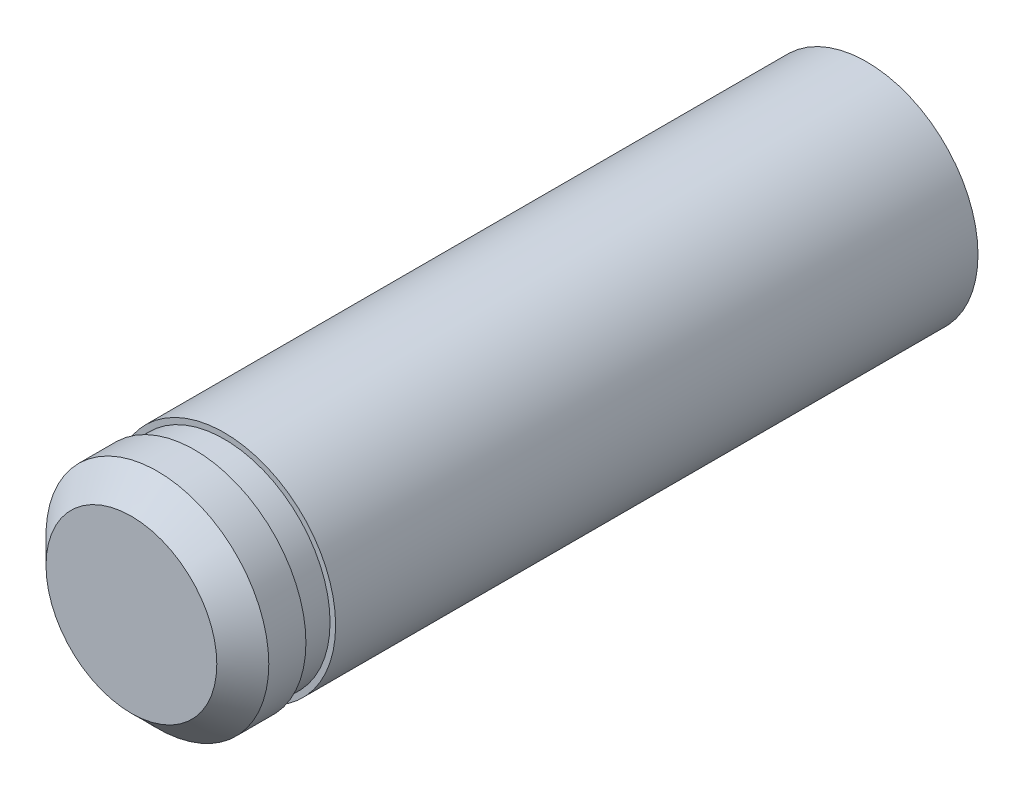
ISO-10303-21;
HEADER;
FILE_DESCRIPTION(('STEP AP214'),'2;1');
FILE_NAME('part.step','',(''),(''),'','','');
FILE_SCHEMA(('AUTOMOTIVE_DESIGN { 1 0 10303 214 1 1 1 1 }'));
ENDSEC;
DATA;
#1=APPLICATION_CONTEXT('core data for automotive mechanical design processes');
#2=APPLICATION_PROTOCOL_DEFINITION('international standard','automotive_design',2000,#1);
#3=PRODUCT_CONTEXT('',#1,'mechanical');
#4=PRODUCT('Part','Part','',(#3));
#5=PRODUCT_RELATED_PRODUCT_CATEGORY('part','',(#4));
#6=PRODUCT_DEFINITION_FORMATION('','',#4);
#7=PRODUCT_DEFINITION_CONTEXT('part definition',#1,'design');
#8=PRODUCT_DEFINITION('design','',#6,#7);
#9=PRODUCT_DEFINITION_SHAPE('','',#8);
#10=(LENGTH_UNIT() NAMED_UNIT(*) SI_UNIT(.MILLI.,.METRE.));
#11=(NAMED_UNIT(*) PLANE_ANGLE_UNIT() SI_UNIT($,.RADIAN.));
#12=(NAMED_UNIT(*) SI_UNIT($,.STERADIAN.) SOLID_ANGLE_UNIT());
#13=UNCERTAINTY_MEASURE_WITH_UNIT(LENGTH_MEASURE(1.E-05),#10,'distance_accuracy_value','');
#14=(GEOMETRIC_REPRESENTATION_CONTEXT(3) GLOBAL_UNCERTAINTY_ASSIGNED_CONTEXT((#13)) GLOBAL_UNIT_ASSIGNED_CONTEXT((#10,
#11,#12)) REPRESENTATION_CONTEXT('',''));
#15=CARTESIAN_POINT('',(0.,0.,0.));
#16=DIRECTION('',(0.,0.,1.));
#17=DIRECTION('',(1.,0.,0.));
#18=AXIS2_PLACEMENT_3D('',#15,#16,#17);
#19=CARTESIAN_POINT('',(0.,0.,0.));
#20=DIRECTION('',(0.,0.,1.));
#21=DIRECTION('',(1.,0.,0.));
#22=AXIS2_PLACEMENT_3D('',#19,#20,#21);
#23=PLANE('',#22);
#24=CARTESIAN_POINT('',(0.,0.,0.));
#25=DIRECTION('',(0.,0.,1.));
#26=DIRECTION('',(1.,0.,0.));
#27=AXIS2_PLACEMENT_3D('',#24,#25,#26);
#28=CIRCLE('',#27,3.);
#29=CARTESIAN_POINT('',(3.,0.,0.));
#30=VERTEX_POINT('',#29);
#31=EDGE_CURVE('E10',#30,#30,#28,.T.);
#32=ORIENTED_EDGE('',*,*,#31,.F.);
#33=EDGE_LOOP('',(#32));
#34=FACE_BOUND('',#33,.T.);
#35=ADVANCED_FACE('F31',(#34),#23,.F.);
#36=CARTESIAN_POINT('',(0.,0.,0.));
#37=DIRECTION('',(0.,0.,1.));
#38=DIRECTION('',(1.,0.,0.));
#39=AXIS2_PLACEMENT_3D('',#36,#37,#38);
#40=CYLINDRICAL_SURFACE('',#39,3.);
#41=CARTESIAN_POINT('',(0.,0.,17.3));
#42=DIRECTION('',(0.,0.,1.));
#43=DIRECTION('',(1.,0.,0.));
#44=AXIS2_PLACEMENT_3D('',#41,#42,#43);
#45=CIRCLE('',#44,3.);
#46=CARTESIAN_POINT('',(3.,0.,17.3));
#47=VERTEX_POINT('',#46);
#48=EDGE_CURVE('E37',#47,#47,#45,.T.);
#49=ORIENTED_EDGE('',*,*,#48,.F.);
#50=EDGE_LOOP('',(#49));
#51=FACE_BOUND('',#50,.T.);
#52=ORIENTED_EDGE('',*,*,#31,.T.);
#53=EDGE_LOOP('',(#52));
#54=FACE_BOUND('',#53,.T.);
#55=ADVANCED_FACE('F88',(#51,#54),#40,.T.);
#56=CARTESIAN_POINT('',(0.,3.,17.3));
#57=DIRECTION('',(0.,0.,-1.));
#58=DIRECTION('',(-1.,0.,0.));
#59=AXIS2_PLACEMENT_3D('',#56,#57,#58);
#60=PLANE('',#59);
#61=CARTESIAN_POINT('',(0.,0.,17.3));
#62=DIRECTION('',(0.,0.,1.));
#63=DIRECTION('',(1.,0.,0.));
#64=AXIS2_PLACEMENT_3D('',#61,#62,#63);
#65=CIRCLE('',#64,2.85);
#66=CARTESIAN_POINT('',(2.85,0.,17.3));
#67=VERTEX_POINT('',#66);
#68=EDGE_CURVE('E41',#67,#67,#65,.T.);
#69=ORIENTED_EDGE('',*,*,#68,.F.);
#70=EDGE_LOOP('',(#69));
#71=FACE_BOUND('',#70,.T.);
#72=ORIENTED_EDGE('',*,*,#48,.T.);
#73=EDGE_LOOP('',(#72));
#74=FACE_BOUND('',#73,.T.);
#75=ADVANCED_FACE('F83',(#71,#74),#60,.F.);
#76=CARTESIAN_POINT('',(0.,0.,0.));
#77=DIRECTION('',(0.,0.,1.));
#78=DIRECTION('',(1.,0.,0.));
#79=AXIS2_PLACEMENT_3D('',#76,#77,#78);
#80=CYLINDRICAL_SURFACE('',#79,2.85);
#81=CARTESIAN_POINT('',(0.,0.,18.1));
#82=DIRECTION('',(0.,0.,1.));
#83=DIRECTION('',(1.,0.,0.));
#84=AXIS2_PLACEMENT_3D('',#81,#82,#83);
#85=CIRCLE('',#84,2.85);
#86=CARTESIAN_POINT('',(2.85,0.,18.1));
#87=VERTEX_POINT('',#86);
#88=EDGE_CURVE('E45',#87,#87,#85,.T.);
#89=ORIENTED_EDGE('',*,*,#88,.F.);
#90=EDGE_LOOP('',(#89));
#91=FACE_BOUND('',#90,.T.);
#92=ORIENTED_EDGE('',*,*,#68,.T.);
#93=EDGE_LOOP('',(#92));
#94=FACE_BOUND('',#93,.T.);
#95=ADVANCED_FACE('F77',(#91,#94),#80,.T.);
#96=CARTESIAN_POINT('',(0.,3.,18.1));
#97=DIRECTION('',(0.,0.,1.));
#98=DIRECTION('',(1.,0.,0.));
#99=AXIS2_PLACEMENT_3D('',#96,#97,#98);
#100=PLANE('',#99);
#101=CARTESIAN_POINT('',(0.,0.,18.1));
#102=DIRECTION('',(0.,0.,1.));
#103=DIRECTION('',(1.,0.,0.));
#104=AXIS2_PLACEMENT_3D('',#101,#102,#103);
#105=CIRCLE('',#104,3.);
#106=CARTESIAN_POINT('',(3.,0.,18.1));
#107=VERTEX_POINT('',#106);
#108=EDGE_CURVE('E50',#107,#107,#105,.T.);
#109=ORIENTED_EDGE('',*,*,#108,.F.);
#110=EDGE_LOOP('',(#109));
#111=FACE_BOUND('',#110,.T.);
#112=ORIENTED_EDGE('',*,*,#88,.T.);
#113=EDGE_LOOP('',(#112));
#114=FACE_BOUND('',#113,.T.);
#115=ADVANCED_FACE('F71',(#111,#114),#100,.F.);
#116=CARTESIAN_POINT('',(0.,0.,0.));
#117=DIRECTION('',(0.,0.,1.));
#118=DIRECTION('',(1.,0.,0.));
#119=AXIS2_PLACEMENT_3D('',#116,#117,#118);
#120=CYLINDRICAL_SURFACE('',#119,3.);
#121=CARTESIAN_POINT('',(0.,0.,19.1));
#122=DIRECTION('',(0.,0.,1.));
#123=DIRECTION('',(1.,0.,0.));
#124=AXIS2_PLACEMENT_3D('',#121,#122,#123);
#125=CIRCLE('',#124,3.);
#126=CARTESIAN_POINT('',(3.,0.,19.1));
#127=VERTEX_POINT('',#126);
#128=EDGE_CURVE('E53',#127,#127,#125,.T.);
#129=ORIENTED_EDGE('',*,*,#128,.F.);
#130=EDGE_LOOP('',(#129));
#131=FACE_BOUND('',#130,.T.);
#132=ORIENTED_EDGE('',*,*,#108,.T.);
#133=EDGE_LOOP('',(#132));
#134=FACE_BOUND('',#133,.T.);
#135=ADVANCED_FACE('F65',(#131,#134),#120,.T.);
#136=CARTESIAN_POINT('',(0.,0.,19.1));
#137=DIRECTION('',(0.,0.,-1.));
#138=DIRECTION('',(-1.,0.,0.));
#139=AXIS2_PLACEMENT_3D('',#136,#137,#138);
#140=CONICAL_SURFACE('',#139,3.,0.78539816339745);
#141=CARTESIAN_POINT('',(0.,0.,19.8));
#142=DIRECTION('',(0.,0.,1.));
#143=DIRECTION('',(1.,0.,0.));
#144=AXIS2_PLACEMENT_3D('',#141,#142,#143);
#145=CIRCLE('',#144,2.3);
#146=CARTESIAN_POINT('',(2.3,0.,19.8));
#147=VERTEX_POINT('',#146);
#148=EDGE_CURVE('E56',#147,#147,#145,.T.);
#149=ORIENTED_EDGE('',*,*,#148,.F.);
#150=EDGE_LOOP('',(#149));
#151=FACE_BOUND('',#150,.T.);
#152=ORIENTED_EDGE('',*,*,#128,.T.);
#153=EDGE_LOOP('',(#152));
#154=FACE_BOUND('',#153,.T.);
#155=ADVANCED_FACE('F62',(#151,#154),#140,.T.);
#156=CARTESIAN_POINT('',(0.,0.,19.8));
#157=DIRECTION('',(0.,0.,-1.));
#158=DIRECTION('',(-1.,0.,0.));
#159=AXIS2_PLACEMENT_3D('',#156,#157,#158);
#160=PLANE('',#159);
#161=ORIENTED_EDGE('',*,*,#148,.T.);
#162=EDGE_LOOP('',(#161));
#163=FACE_BOUND('',#162,.T.);
#164=ADVANCED_FACE('F60',(#163),#160,.F.);
#165=CLOSED_SHELL('',(#35,#55,#75,#95,#115,#135,#155,#164));
#166=MANIFOLD_SOLID_BREP('B2',#165);
#167=ADVANCED_BREP_SHAPE_REPRESENTATION('',(#18,#166),#14);
#168=SHAPE_DEFINITION_REPRESENTATION(#9,#167);
ENDSEC;
END-ISO-10303-21;
